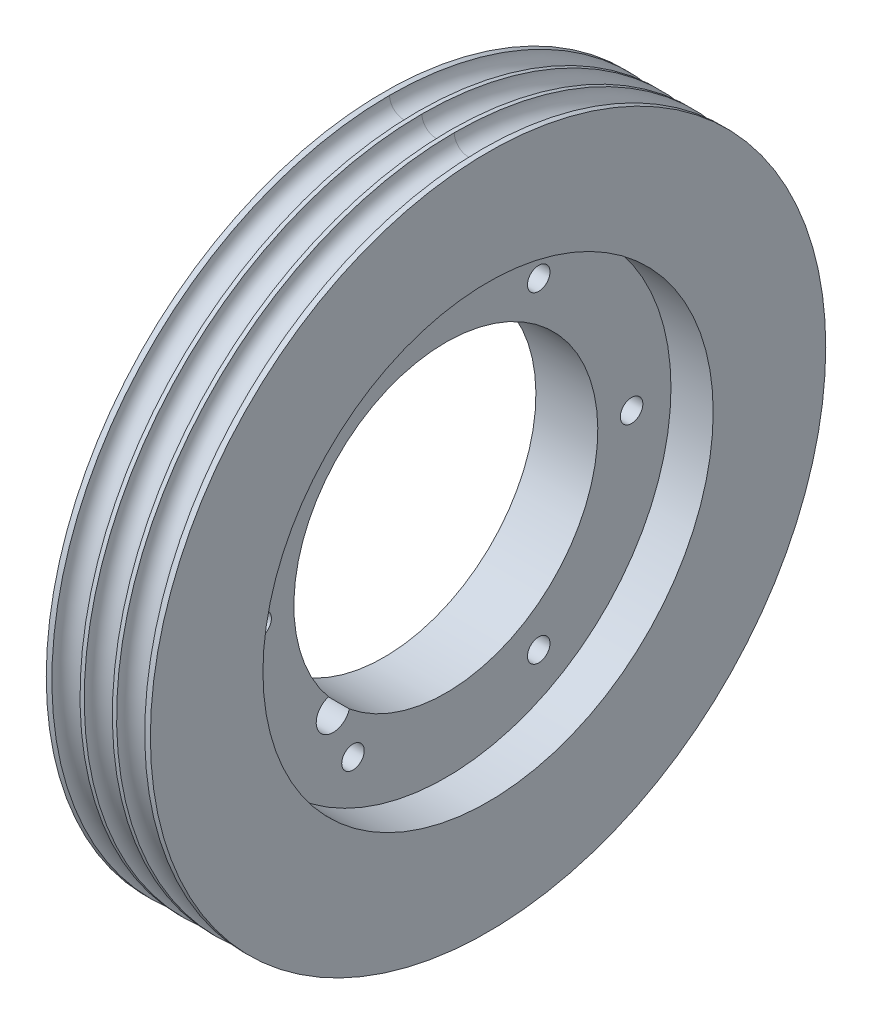
ISO-10303-21;
HEADER;
FILE_DESCRIPTION(('STEP AP214'),'2;1');
FILE_NAME('part.step','',(''),(''),'','','');
FILE_SCHEMA(('AUTOMOTIVE_DESIGN { 1 0 10303 214 1 1 1 1 }'));
ENDSEC;
DATA;
#1=APPLICATION_CONTEXT('core data for automotive mechanical design processes');
#2=APPLICATION_PROTOCOL_DEFINITION('international standard','automotive_design',2000,#1);
#3=PRODUCT_CONTEXT('',#1,'mechanical');
#4=PRODUCT('Part','Part','',(#3));
#5=PRODUCT_RELATED_PRODUCT_CATEGORY('part','',(#4));
#6=PRODUCT_DEFINITION_FORMATION('','',#4);
#7=PRODUCT_DEFINITION_CONTEXT('part definition',#1,'design');
#8=PRODUCT_DEFINITION('design','',#6,#7);
#9=PRODUCT_DEFINITION_SHAPE('','',#8);
#10=(LENGTH_UNIT() NAMED_UNIT(*) SI_UNIT(.MILLI.,.METRE.));
#11=(NAMED_UNIT(*) PLANE_ANGLE_UNIT() SI_UNIT($,.RADIAN.));
#12=(NAMED_UNIT(*) SI_UNIT($,.STERADIAN.) SOLID_ANGLE_UNIT());
#13=UNCERTAINTY_MEASURE_WITH_UNIT(LENGTH_MEASURE(1.E-05),#10,'distance_accuracy_value','');
#14=(GEOMETRIC_REPRESENTATION_CONTEXT(3) GLOBAL_UNCERTAINTY_ASSIGNED_CONTEXT((#13)) GLOBAL_UNIT_ASSIGNED_CONTEXT((#10,
#11,#12)) REPRESENTATION_CONTEXT('',''));
#15=CARTESIAN_POINT('',(0.,0.,0.));
#16=DIRECTION('',(0.,0.,1.));
#17=DIRECTION('',(1.,0.,0.));
#18=AXIS2_PLACEMENT_3D('',#15,#16,#17);
#19=CARTESIAN_POINT('',(5.75,0.,0.));
#20=DIRECTION('',(-1.,0.,0.));
#21=DIRECTION('',(0.,0.,1.));
#22=AXIS2_PLACEMENT_3D('',#19,#20,#21);
#23=CYLINDRICAL_SURFACE('',#22,27.);
#24=CARTESIAN_POINT('',(1.75,0.,0.));
#25=DIRECTION('',(1.,0.,0.));
#26=DIRECTION('',(0.,0.,-1.));
#27=AXIS2_PLACEMENT_3D('',#24,#25,#26);
#28=CIRCLE('',#27,27.);
#29=CARTESIAN_POINT('',(1.75,-17.1475452913862,20.8557351939427));
#30=VERTEX_POINT('',#29);
#31=CARTESIAN_POINT('',(1.75,-20.8557351939425,17.1475452913864));
#32=VERTEX_POINT('',#31);
#33=EDGE_CURVE('E46',#30,#32,#28,.F.);
#34=ORIENTED_EDGE('',*,*,#33,.F.);
#35=DIRECTION('',(-1.,0.,0.));
#36=VECTOR('',#35,1.);
#37=CARTESIAN_POINT('',(-1.75,-17.1475452913862,20.8557351939427));
#38=LINE('',#37,#36);
#39=CARTESIAN_POINT('',(-9.25,-17.1475452913862,20.8557351939427));
#40=VERTEX_POINT('',#39);
#41=EDGE_CURVE('E102',#40,#30,#38,.F.);
#42=ORIENTED_EDGE('',*,*,#41,.F.);
#43=CARTESIAN_POINT('',(-9.25,0.,0.));
#44=DIRECTION('',(-1.,0.,0.));
#45=DIRECTION('',(0.,0.,1.));
#46=AXIS2_PLACEMENT_3D('',#43,#44,#45);
#47=CIRCLE('',#46,27.);
#48=CARTESIAN_POINT('',(-9.25,-20.8557351939425,17.1475452913864));
#49=VERTEX_POINT('',#48);
#50=EDGE_CURVE('E158',#40,#49,#47,.T.);
#51=ORIENTED_EDGE('',*,*,#50,.T.);
#52=DIRECTION('',(-1.,0.,0.));
#53=VECTOR('',#52,1.);
#54=CARTESIAN_POINT('',(-1.75,-20.8557351939425,17.1475452913864));
#55=LINE('',#54,#53);
#56=EDGE_CURVE('E104',#32,#49,#55,.T.);
#57=ORIENTED_EDGE('',*,*,#56,.F.);
#58=EDGE_LOOP('',(#34,#42,#51,#57));
#59=FACE_BOUND('',#58,.T.);
#60=ADVANCED_FACE('F33',(#59),#23,.F.);
#61=CARTESIAN_POINT('',(5.75,0.,33.));
#62=DIRECTION('',(-1.,0.,0.));
#63=DIRECTION('',(0.,0.,1.));
#64=AXIS2_PLACEMENT_3D('',#61,#62,#63);
#65=CYLINDRICAL_SURFACE('',#64,2.);
#66=CARTESIAN_POINT('',(-6.25,0.,33.));
#67=DIRECTION('',(-1.,0.,0.));
#68=DIRECTION('',(0.,0.,1.));
#69=AXIS2_PLACEMENT_3D('',#66,#67,#68);
#70=CIRCLE('',#69,2.);
#71=CARTESIAN_POINT('',(-6.25,0.,35.));
#72=VERTEX_POINT('',#71);
#73=EDGE_CURVE('E153',#72,#72,#70,.F.);
#74=ORIENTED_EDGE('',*,*,#73,.F.);
#75=EDGE_LOOP('',(#74));
#76=FACE_BOUND('',#75,.T.);
#77=CARTESIAN_POINT('',(1.75,0.,33.));
#78=DIRECTION('',(1.,0.,0.));
#79=DIRECTION('',(0.,0.,-1.));
#80=AXIS2_PLACEMENT_3D('',#77,#78,#79);
#81=CIRCLE('',#80,2.);
#82=CARTESIAN_POINT('',(1.75,0.,31.));
#83=VERTEX_POINT('',#82);
#84=EDGE_CURVE('E288',#83,#83,#81,.F.);
#85=ORIENTED_EDGE('',*,*,#84,.F.);
#86=EDGE_LOOP('',(#85));
#87=FACE_BOUND('',#86,.T.);
#88=ADVANCED_FACE('F236',(#76,#87),#65,.F.);
#89=CARTESIAN_POINT('',(5.75,-28.5788383248863,16.5000000000003));
#90=DIRECTION('',(-1.,0.,0.));
#91=DIRECTION('',(0.,0.,1.));
#92=AXIS2_PLACEMENT_3D('',#89,#90,#91);
#93=CYLINDRICAL_SURFACE('',#92,2.);
#94=CARTESIAN_POINT('',(-6.25,-28.5788383248863,16.5000000000003));
#95=DIRECTION('',(-1.,0.,0.));
#96=DIRECTION('',(0.,0.,1.));
#97=AXIS2_PLACEMENT_3D('',#94,#95,#96);
#98=CIRCLE('',#97,2.);
#99=CARTESIAN_POINT('',(-6.25,-28.5788383248863,18.5000000000003));
#100=VERTEX_POINT('',#99);
#101=EDGE_CURVE('E147',#100,#100,#98,.F.);
#102=ORIENTED_EDGE('',*,*,#101,.F.);
#103=EDGE_LOOP('',(#102));
#104=FACE_BOUND('',#103,.T.);
#105=CARTESIAN_POINT('',(1.75,-28.5788383248863,16.5000000000003));
#106=DIRECTION('',(1.,0.,0.));
#107=DIRECTION('',(0.,0.,-1.));
#108=AXIS2_PLACEMENT_3D('',#105,#106,#107);
#109=CIRCLE('',#108,2.);
#110=CARTESIAN_POINT('',(1.75,-28.5788383248863,14.5000000000003));
#111=VERTEX_POINT('',#110);
#112=EDGE_CURVE('E291',#111,#111,#109,.F.);
#113=ORIENTED_EDGE('',*,*,#112,.F.);
#114=EDGE_LOOP('',(#113));
#115=FACE_BOUND('',#114,.T.);
#116=ADVANCED_FACE('F241',(#104,#115),#93,.F.);
#117=CARTESIAN_POINT('',(5.75,-28.5788383248866,-16.4999999999997));
#118=DIRECTION('',(-1.,0.,0.));
#119=DIRECTION('',(0.,0.,1.));
#120=AXIS2_PLACEMENT_3D('',#117,#118,#119);
#121=CYLINDRICAL_SURFACE('',#120,2.);
#122=CARTESIAN_POINT('',(-6.25,-28.5788383248866,-16.4999999999997));
#123=DIRECTION('',(-1.,0.,0.));
#124=DIRECTION('',(0.,0.,1.));
#125=AXIS2_PLACEMENT_3D('',#122,#123,#124);
#126=CIRCLE('',#125,2.);
#127=CARTESIAN_POINT('',(-6.25,-28.5788383248866,-14.4999999999997));
#128=VERTEX_POINT('',#127);
#129=EDGE_CURVE('E171',#128,#128,#126,.F.);
#130=ORIENTED_EDGE('',*,*,#129,.F.);
#131=EDGE_LOOP('',(#130));
#132=FACE_BOUND('',#131,.T.);
#133=CARTESIAN_POINT('',(1.75,-28.5788383248866,-16.4999999999997));
#134=DIRECTION('',(1.,0.,0.));
#135=DIRECTION('',(0.,0.,-1.));
#136=AXIS2_PLACEMENT_3D('',#133,#134,#135);
#137=CIRCLE('',#136,2.);
#138=CARTESIAN_POINT('',(1.75,-28.5788383248866,-18.4999999999997));
#139=VERTEX_POINT('',#138);
#140=EDGE_CURVE('E294',#139,#139,#137,.F.);
#141=ORIENTED_EDGE('',*,*,#140,.F.);
#142=EDGE_LOOP('',(#141));
#143=FACE_BOUND('',#142,.T.);
#144=ADVANCED_FACE('F389',(#132,#143),#121,.F.);
#145=CARTESIAN_POINT('',(5.75,0.,-33.));
#146=DIRECTION('',(-1.,0.,0.));
#147=DIRECTION('',(0.,0.,1.));
#148=AXIS2_PLACEMENT_3D('',#145,#146,#147);
#149=CYLINDRICAL_SURFACE('',#148,2.);
#150=CARTESIAN_POINT('',(-6.25,0.,-33.));
#151=DIRECTION('',(-1.,0.,0.));
#152=DIRECTION('',(0.,0.,1.));
#153=AXIS2_PLACEMENT_3D('',#150,#151,#152);
#154=CIRCLE('',#153,2.);
#155=CARTESIAN_POINT('',(-6.25,0.,-31.));
#156=VERTEX_POINT('',#155);
#157=EDGE_CURVE('E174',#156,#156,#154,.F.);
#158=ORIENTED_EDGE('',*,*,#157,.F.);
#159=EDGE_LOOP('',(#158));
#160=FACE_BOUND('',#159,.T.);
#161=CARTESIAN_POINT('',(1.75,0.,-33.));
#162=DIRECTION('',(1.,0.,0.));
#163=DIRECTION('',(0.,0.,-1.));
#164=AXIS2_PLACEMENT_3D('',#161,#162,#163);
#165=CIRCLE('',#164,2.);
#166=CARTESIAN_POINT('',(1.75,0.,-35.));
#167=VERTEX_POINT('',#166);
#168=EDGE_CURVE('E297',#167,#167,#165,.F.);
#169=ORIENTED_EDGE('',*,*,#168,.F.);
#170=EDGE_LOOP('',(#169));
#171=FACE_BOUND('',#170,.T.);
#172=ADVANCED_FACE('F385',(#160,#171),#149,.F.);
#173=CARTESIAN_POINT('',(5.75,28.5788383248864,-16.5000000000001));
#174=DIRECTION('',(-1.,0.,0.));
#175=DIRECTION('',(0.,0.,1.));
#176=AXIS2_PLACEMENT_3D('',#173,#174,#175);
#177=CYLINDRICAL_SURFACE('',#176,2.);
#178=CARTESIAN_POINT('',(-6.25,28.5788383248864,-16.5000000000001));
#179=DIRECTION('',(-1.,0.,0.));
#180=DIRECTION('',(0.,0.,1.));
#181=AXIS2_PLACEMENT_3D('',#178,#179,#180);
#182=CIRCLE('',#181,2.);
#183=CARTESIAN_POINT('',(-6.25,28.5788383248864,-14.5000000000001));
#184=VERTEX_POINT('',#183);
#185=EDGE_CURVE('E177',#184,#184,#182,.F.);
#186=ORIENTED_EDGE('',*,*,#185,.F.);
#187=EDGE_LOOP('',(#186));
#188=FACE_BOUND('',#187,.T.);
#189=CARTESIAN_POINT('',(1.75,28.5788383248864,-16.5000000000001));
#190=DIRECTION('',(1.,0.,0.));
#191=DIRECTION('',(0.,0.,-1.));
#192=AXIS2_PLACEMENT_3D('',#189,#190,#191);
#193=CIRCLE('',#192,2.);
#194=CARTESIAN_POINT('',(1.75,28.5788383248864,-18.5000000000001));
#195=VERTEX_POINT('',#194);
#196=EDGE_CURVE('E300',#195,#195,#193,.F.);
#197=ORIENTED_EDGE('',*,*,#196,.F.);
#198=EDGE_LOOP('',(#197));
#199=FACE_BOUND('',#198,.T.);
#200=ADVANCED_FACE('F382',(#188,#199),#177,.F.);
#201=CARTESIAN_POINT('',(5.75,28.5788383248865,16.4999999999999));
#202=DIRECTION('',(-1.,0.,0.));
#203=DIRECTION('',(0.,0.,1.));
#204=AXIS2_PLACEMENT_3D('',#201,#202,#203);
#205=CYLINDRICAL_SURFACE('',#204,2.);
#206=CARTESIAN_POINT('',(-6.25,28.5788383248865,16.4999999999999));
#207=DIRECTION('',(-1.,0.,0.));
#208=DIRECTION('',(0.,0.,1.));
#209=AXIS2_PLACEMENT_3D('',#206,#207,#208);
#210=CIRCLE('',#209,2.);
#211=CARTESIAN_POINT('',(-6.25,28.5788383248865,18.4999999999999));
#212=VERTEX_POINT('',#211);
#213=EDGE_CURVE('E157',#212,#212,#210,.F.);
#214=ORIENTED_EDGE('',*,*,#213,.F.);
#215=EDGE_LOOP('',(#214));
#216=FACE_BOUND('',#215,.T.);
#217=CARTESIAN_POINT('',(1.75,28.5788383248865,16.4999999999999));
#218=DIRECTION('',(1.,0.,0.));
#219=DIRECTION('',(0.,0.,-1.));
#220=AXIS2_PLACEMENT_3D('',#217,#218,#219);
#221=CIRCLE('',#220,2.);
#222=CARTESIAN_POINT('',(1.75,28.5788383248865,14.4999999999999));
#223=VERTEX_POINT('',#222);
#224=EDGE_CURVE('E105',#223,#223,#221,.F.);
#225=ORIENTED_EDGE('',*,*,#224,.F.);
#226=EDGE_LOOP('',(#225));
#227=FACE_BOUND('',#226,.T.);
#228=ADVANCED_FACE('F342',(#216,#227),#205,.F.);
#229=CARTESIAN_POINT('',(9.251,-20.0323351110148,20.032335111015));
#230=DIRECTION('',(-1.,0.,0.));
#231=DIRECTION('',(0.,0.,1.));
#232=AXIS2_PLACEMENT_3D('',#229,#230,#231);
#233=CYLINDRICAL_SURFACE('',#232,2.99999999999965);
#234=CARTESIAN_POINT('',(1.75,-20.0323351110148,20.032335111015));
#235=DIRECTION('',(1.,0.,0.));
#236=DIRECTION('',(0.,0.,-1.));
#237=AXIS2_PLACEMENT_3D('',#234,#235,#236);
#238=CIRCLE('',#237,2.99999999999965);
#239=EDGE_CURVE('E11',#32,#30,#238,.F.);
#240=ORIENTED_EDGE('',*,*,#239,.F.);
#241=ORIENTED_EDGE('',*,*,#56,.T.);
#242=CARTESIAN_POINT('',(-9.25,-20.0323351110148,20.032335111015));
#243=DIRECTION('',(-1.,0.,0.));
#244=DIRECTION('',(0.,0.,1.));
#245=AXIS2_PLACEMENT_3D('',#242,#243,#244);
#246=CIRCLE('',#245,2.99999999999965);
#247=EDGE_CURVE('E110',#49,#40,#246,.T.);
#248=ORIENTED_EDGE('',*,*,#247,.T.);
#249=ORIENTED_EDGE('',*,*,#41,.T.);
#250=EDGE_LOOP('',(#240,#241,#248,#249));
#251=FACE_BOUND('',#250,.T.);
#252=ADVANCED_FACE('F108',(#251),#233,.F.);
#253=CARTESIAN_POINT('',(9.25,0.,0.));
#254=DIRECTION('',(-1.,0.,0.));
#255=DIRECTION('',(0.,0.,1.));
#256=AXIS2_PLACEMENT_3D('',#253,#254,#255);
#257=CYLINDRICAL_SURFACE('',#256,60.);
#258=CARTESIAN_POINT('',(-3.2500100945521,0.,0.));
#259=DIRECTION('',(-1.,0.,0.));
#260=DIRECTION('',(0.,0.,1.));
#261=AXIS2_PLACEMENT_3D('',#258,#259,#260);
#262=CIRCLE('',#261,60.);
#263=CARTESIAN_POINT('',(-3.2500100945521,60.,0.));
#264=VERTEX_POINT('',#263);
#265=CARTESIAN_POINT('',(-3.2500100945521,0.,-60.));
#266=VERTEX_POINT('',#265);
#267=EDGE_CURVE('E193',#264,#266,#262,.T.);
#268=ORIENTED_EDGE('',*,*,#267,.F.);
#269=CARTESIAN_POINT('',(-3.2500100945521,0.,0.));
#270=DIRECTION('',(-1.,0.,0.));
#271=DIRECTION('',(0.,0.,1.));
#272=AXIS2_PLACEMENT_3D('',#269,#270,#271);
#273=CIRCLE('',#272,60.);
#274=EDGE_CURVE('E191',#266,#264,#273,.T.);
#275=ORIENTED_EDGE('',*,*,#274,.F.);
#276=EDGE_LOOP('',(#268,#275));
#277=FACE_BOUND('',#276,.T.);
#278=CARTESIAN_POINT('',(-2.49998990544789,0.,0.));
#279=DIRECTION('',(1.,0.,0.));
#280=DIRECTION('',(0.,0.,-1.));
#281=AXIS2_PLACEMENT_3D('',#278,#279,#280);
#282=CIRCLE('',#281,60.);
#283=CARTESIAN_POINT('',(-2.49998990544789,0.,-60.));
#284=VERTEX_POINT('',#283);
#285=CARTESIAN_POINT('',(-2.49998990544789,60.,0.));
#286=VERTEX_POINT('',#285);
#287=EDGE_CURVE('E41',#284,#286,#282,.T.);
#288=ORIENTED_EDGE('',*,*,#287,.F.);
#289=CARTESIAN_POINT('',(-2.49998990544789,0.,0.));
#290=DIRECTION('',(1.,0.,0.));
#291=DIRECTION('',(0.,0.,-1.));
#292=AXIS2_PLACEMENT_3D('',#289,#290,#291);
#293=CIRCLE('',#292,60.);
#294=EDGE_CURVE('E206',#286,#284,#293,.T.);
#295=ORIENTED_EDGE('',*,*,#294,.F.);
#296=EDGE_LOOP('',(#288,#295));
#297=FACE_BOUND('',#296,.T.);
#298=ADVANCED_FACE('F215',(#277,#297),#257,.T.);
#299=CARTESIAN_POINT('',(3.2500100945521,0.,0.));
#300=DIRECTION('',(1.,0.,0.));
#301=DIRECTION('',(0.,0.,-1.));
#302=AXIS2_PLACEMENT_3D('',#299,#300,#301);
#303=CIRCLE('',#302,60.);
#304=CARTESIAN_POINT('',(3.2500100945521,0.,-60.));
#305=VERTEX_POINT('',#304);
#306=CARTESIAN_POINT('',(3.2500100945521,60.,0.));
#307=VERTEX_POINT('',#306);
#308=EDGE_CURVE('E188',#305,#307,#303,.T.);
#309=ORIENTED_EDGE('',*,*,#308,.F.);
#310=CARTESIAN_POINT('',(3.2500100945521,0.,0.));
#311=DIRECTION('',(1.,0.,0.));
#312=DIRECTION('',(0.,0.,-1.));
#313=AXIS2_PLACEMENT_3D('',#310,#311,#312);
#314=CIRCLE('',#313,60.);
#315=EDGE_CURVE('E186',#307,#305,#314,.T.);
#316=ORIENTED_EDGE('',*,*,#315,.F.);
#317=EDGE_LOOP('',(#309,#316));
#318=FACE_BOUND('',#317,.T.);
#319=CARTESIAN_POINT('',(2.49998990544789,0.,0.));
#320=DIRECTION('',(-1.,0.,0.));
#321=DIRECTION('',(0.,0.,1.));
#322=AXIS2_PLACEMENT_3D('',#319,#320,#321);
#323=CIRCLE('',#322,60.);
#324=CARTESIAN_POINT('',(2.49998990544789,60.,0.));
#325=VERTEX_POINT('',#324);
#326=CARTESIAN_POINT('',(2.49998990544789,0.,-60.));
#327=VERTEX_POINT('',#326);
#328=EDGE_CURVE('E203',#325,#327,#323,.T.);
#329=ORIENTED_EDGE('',*,*,#328,.F.);
#330=CARTESIAN_POINT('',(2.49998990544789,0.,0.));
#331=DIRECTION('',(-1.,0.,0.));
#332=DIRECTION('',(0.,0.,1.));
#333=AXIS2_PLACEMENT_3D('',#330,#331,#332);
#334=CIRCLE('',#333,60.);
#335=EDGE_CURVE('E201',#327,#325,#334,.T.);
#336=ORIENTED_EDGE('',*,*,#335,.F.);
#337=EDGE_LOOP('',(#329,#336));
#338=FACE_BOUND('',#337,.T.);
#339=ADVANCED_FACE('F221',(#318,#338),#257,.T.);
#340=CARTESIAN_POINT('',(-9.25,0.,0.));
#341=DIRECTION('',(1.,0.,0.));
#342=DIRECTION('',(0.,0.,-1.));
#343=AXIS2_PLACEMENT_3D('',#340,#341,#342);
#344=CIRCLE('',#343,60.);
#345=CARTESIAN_POINT('',(-9.25,0.,-60.));
#346=VERTEX_POINT('',#345);
#347=EDGE_CURVE('E160',#346,#346,#344,.T.);
#348=ORIENTED_EDGE('',*,*,#347,.T.);
#349=EDGE_LOOP('',(#348));
#350=FACE_BOUND('',#349,.T.);
#351=CARTESIAN_POINT('',(-8.2499899054479,0.,0.));
#352=DIRECTION('',(1.,0.,0.));
#353=DIRECTION('',(0.,0.,-1.));
#354=AXIS2_PLACEMENT_3D('',#351,#352,#353);
#355=CIRCLE('',#354,60.);
#356=CARTESIAN_POINT('',(-8.2499899054479,0.,-59.9999999999999));
#357=VERTEX_POINT('',#356);
#358=CARTESIAN_POINT('',(-8.2499899054479,59.9999999999999,0.));
#359=VERTEX_POINT('',#358);
#360=EDGE_CURVE('E198',#357,#359,#355,.T.);
#361=ORIENTED_EDGE('',*,*,#360,.F.);
#362=CARTESIAN_POINT('',(-8.2499899054479,0.,0.));
#363=DIRECTION('',(1.,0.,0.));
#364=DIRECTION('',(0.,0.,-1.));
#365=AXIS2_PLACEMENT_3D('',#362,#363,#364);
#366=CIRCLE('',#365,60.);
#367=EDGE_CURVE('E196',#359,#357,#366,.T.);
#368=ORIENTED_EDGE('',*,*,#367,.F.);
#369=EDGE_LOOP('',(#361,#368));
#370=FACE_BOUND('',#369,.T.);
#371=ADVANCED_FACE('F35',(#350,#370),#257,.T.);
#372=CARTESIAN_POINT('',(9.25,0.,0.));
#373=DIRECTION('',(1.,0.,0.));
#374=DIRECTION('',(0.,0.,-1.));
#375=AXIS2_PLACEMENT_3D('',#372,#373,#374);
#376=CIRCLE('',#375,60.);
#377=CARTESIAN_POINT('',(9.25,0.,-60.));
#378=VERTEX_POINT('',#377);
#379=EDGE_CURVE('E161',#378,#378,#376,.T.);
#380=ORIENTED_EDGE('',*,*,#379,.F.);
#381=EDGE_LOOP('',(#380));
#382=FACE_BOUND('',#381,.T.);
#383=CARTESIAN_POINT('',(8.2499899054479,0.,0.));
#384=DIRECTION('',(-1.,0.,0.));
#385=DIRECTION('',(0.,0.,1.));
#386=AXIS2_PLACEMENT_3D('',#383,#384,#385);
#387=CIRCLE('',#386,60.);
#388=CARTESIAN_POINT('',(8.2499899054479,59.9999999999999,0.));
#389=VERTEX_POINT('',#388);
#390=CARTESIAN_POINT('',(8.2499899054479,0.,-59.9999999999999));
#391=VERTEX_POINT('',#390);
#392=EDGE_CURVE('E183',#389,#391,#387,.T.);
#393=ORIENTED_EDGE('',*,*,#392,.F.);
#394=CARTESIAN_POINT('',(8.2499899054479,0.,0.));
#395=DIRECTION('',(-1.,0.,0.));
#396=DIRECTION('',(0.,0.,1.));
#397=AXIS2_PLACEMENT_3D('',#394,#395,#396);
#398=CIRCLE('',#397,60.);
#399=EDGE_CURVE('E164',#391,#389,#398,.T.);
#400=ORIENTED_EDGE('',*,*,#399,.F.);
#401=EDGE_LOOP('',(#393,#400));
#402=FACE_BOUND('',#401,.T.);
#403=ADVANCED_FACE('F224',(#382,#402),#257,.T.);
#404=CARTESIAN_POINT('',(9.25,0.,0.));
#405=DIRECTION('',(1.,0.,0.));
#406=DIRECTION('',(0.,0.,-1.));
#407=AXIS2_PLACEMENT_3D('',#404,#405,#406);
#408=PLANE('',#407);
#409=CARTESIAN_POINT('',(9.25,0.,0.));
#410=DIRECTION('',(1.,0.,0.));
#411=DIRECTION('',(0.,0.,-1.));
#412=AXIS2_PLACEMENT_3D('',#409,#410,#411);
#413=CIRCLE('',#412,40.);
#414=CARTESIAN_POINT('',(9.25,0.,-40.));
#415=VERTEX_POINT('',#414);
#416=EDGE_CURVE('E305',#415,#415,#413,.T.);
#417=ORIENTED_EDGE('',*,*,#416,.F.);
#418=EDGE_LOOP('',(#417));
#419=FACE_BOUND('',#418,.T.);
#420=ORIENTED_EDGE('',*,*,#379,.T.);
#421=EDGE_LOOP('',(#420));
#422=FACE_BOUND('',#421,.T.);
#423=ADVANCED_FACE('F233',(#419,#422),#408,.T.);
#424=CARTESIAN_POINT('',(-9.25,0.,0.));
#425=DIRECTION('',(1.,0.,0.));
#426=DIRECTION('',(0.,0.,-1.));
#427=AXIS2_PLACEMENT_3D('',#424,#425,#426);
#428=PLANE('',#427);
#429=CARTESIAN_POINT('',(-9.25,-28.5788383248863,16.5000000000003));
#430=DIRECTION('',(-1.,0.,0.));
#431=DIRECTION('',(0.,-0.866025403784433,0.50000000000001));
#432=AXIS2_PLACEMENT_3D('',#429,#430,#431);
#433=CIRCLE('',#432,4.00000000000001);
#434=CARTESIAN_POINT('',(-9.25,-32.042939940024,18.5000000000004));
#435=VERTEX_POINT('',#434);
#436=EDGE_CURVE('E119',#435,#435,#433,.T.);
#437=ORIENTED_EDGE('',*,*,#436,.F.);
#438=EDGE_LOOP('',(#437));
#439=FACE_BOUND('',#438,.T.);
#440=CARTESIAN_POINT('',(-9.25,-28.5788383248866,-16.4999999999997));
#441=DIRECTION('',(-1.,0.,0.));
#442=DIRECTION('',(0.,-0.866025403784443,-0.499999999999992));
#443=AXIS2_PLACEMENT_3D('',#440,#441,#442);
#444=CIRCLE('',#443,4.00000000000001);
#445=CARTESIAN_POINT('',(-9.25,-32.0429399400244,-18.4999999999997));
#446=VERTEX_POINT('',#445);
#447=EDGE_CURVE('E136',#446,#446,#444,.T.);
#448=ORIENTED_EDGE('',*,*,#447,.F.);
#449=EDGE_LOOP('',(#448));
#450=FACE_BOUND('',#449,.T.);
#451=CARTESIAN_POINT('',(-9.25,0.,-33.));
#452=DIRECTION('',(-1.,0.,0.));
#453=DIRECTION('',(0.,0.,-1.));
#454=AXIS2_PLACEMENT_3D('',#451,#452,#453);
#455=CIRCLE('',#454,4.00000000000001);
#456=CARTESIAN_POINT('',(-9.25,0.,-37.));
#457=VERTEX_POINT('',#456);
#458=EDGE_CURVE('E130',#457,#457,#455,.T.);
#459=ORIENTED_EDGE('',*,*,#458,.F.);
#460=EDGE_LOOP('',(#459));
#461=FACE_BOUND('',#460,.T.);
#462=CARTESIAN_POINT('',(-9.25,28.5788383248864,-16.5000000000001));
#463=DIRECTION('',(-1.,0.,0.));
#464=DIRECTION('',(0.,0.866025403784436,-0.500000000000004));
#465=AXIS2_PLACEMENT_3D('',#462,#463,#464);
#466=CIRCLE('',#465,4.00000000000001);
#467=CARTESIAN_POINT('',(-9.25,32.0429399400242,-18.5000000000002));
#468=VERTEX_POINT('',#467);
#469=EDGE_CURVE('E124',#468,#468,#466,.T.);
#470=ORIENTED_EDGE('',*,*,#469,.F.);
#471=EDGE_LOOP('',(#470));
#472=FACE_BOUND('',#471,.T.);
#473=CARTESIAN_POINT('',(-9.25,28.5788383248865,16.4999999999999));
#474=DIRECTION('',(-1.,0.,0.));
#475=DIRECTION('',(0.,0.86602540378444,0.499999999999998));
#476=AXIS2_PLACEMENT_3D('',#473,#474,#475);
#477=CIRCLE('',#476,4.00000000000001);
#478=CARTESIAN_POINT('',(-9.25,32.0429399400243,18.4999999999999));
#479=VERTEX_POINT('',#478);
#480=EDGE_CURVE('E123',#479,#479,#477,.T.);
#481=ORIENTED_EDGE('',*,*,#480,.F.);
#482=EDGE_LOOP('',(#481));
#483=FACE_BOUND('',#482,.T.);
#484=CARTESIAN_POINT('',(-9.25,0.,33.));
#485=DIRECTION('',(-1.,0.,0.));
#486=DIRECTION('',(0.,0.,1.));
#487=AXIS2_PLACEMENT_3D('',#484,#485,#486);
#488=CIRCLE('',#487,4.00000000000001);
#489=CARTESIAN_POINT('',(-9.25,0.,37.));
#490=VERTEX_POINT('',#489);
#491=EDGE_CURVE('E154',#490,#490,#488,.T.);
#492=ORIENTED_EDGE('',*,*,#491,.F.);
#493=EDGE_LOOP('',(#492));
#494=FACE_BOUND('',#493,.T.);
#495=ORIENTED_EDGE('',*,*,#50,.F.);
#496=ORIENTED_EDGE('',*,*,#247,.F.);
#497=EDGE_LOOP('',(#495,#496));
#498=FACE_BOUND('',#497,.T.);
#499=ORIENTED_EDGE('',*,*,#347,.F.);
#500=EDGE_LOOP('',(#499));
#501=FACE_BOUND('',#500,.T.);
#502=ADVANCED_FACE('F247',(#439,#450,#461,#472,#483,#494,#498,#501),#428,.F.);
#503=CARTESIAN_POINT('',(-6.25,0.,33.));
#504=DIRECTION('',(-1.,0.,0.));
#505=DIRECTION('',(0.,0.,1.));
#506=AXIS2_PLACEMENT_3D('',#503,#504,#505);
#507=PLANE('',#506);
#508=CARTESIAN_POINT('',(-6.25,0.,33.));
#509=DIRECTION('',(-1.,0.,0.));
#510=DIRECTION('',(0.,0.,1.));
#511=AXIS2_PLACEMENT_3D('',#508,#509,#510);
#512=CIRCLE('',#511,4.00000000000001);
#513=CARTESIAN_POINT('',(-6.25,0.,37.));
#514=VERTEX_POINT('',#513);
#515=EDGE_CURVE('E150',#514,#514,#512,.T.);
#516=ORIENTED_EDGE('',*,*,#515,.T.);
#517=EDGE_LOOP('',(#516));
#518=FACE_BOUND('',#517,.T.);
#519=ORIENTED_EDGE('',*,*,#73,.T.);
#520=EDGE_LOOP('',(#519));
#521=FACE_BOUND('',#520,.T.);
#522=ADVANCED_FACE('F250',(#518,#521),#507,.T.);
#523=CARTESIAN_POINT('',(-6.25,0.,33.));
#524=DIRECTION('',(-1.,0.,0.));
#525=DIRECTION('',(0.,0.,1.));
#526=AXIS2_PLACEMENT_3D('',#523,#524,#525);
#527=CYLINDRICAL_SURFACE('',#526,4.00000000000001);
#528=ORIENTED_EDGE('',*,*,#515,.F.);
#529=EDGE_LOOP('',(#528));
#530=FACE_BOUND('',#529,.T.);
#531=ORIENTED_EDGE('',*,*,#491,.T.);
#532=EDGE_LOOP('',(#531));
#533=FACE_BOUND('',#532,.T.);
#534=ADVANCED_FACE('F255',(#530,#533),#527,.F.);
#535=CARTESIAN_POINT('',(-6.25,-28.5788383248863,16.5000000000003));
#536=DIRECTION('',(-1.,0.,0.));
#537=DIRECTION('',(0.,-0.866025403784433,0.50000000000001));
#538=AXIS2_PLACEMENT_3D('',#535,#536,#537);
#539=PLANE('',#538);
#540=CARTESIAN_POINT('',(-6.25,-28.5788383248863,16.5000000000003));
#541=DIRECTION('',(-1.,0.,0.));
#542=DIRECTION('',(0.,-0.866025403784433,0.50000000000001));
#543=AXIS2_PLACEMENT_3D('',#540,#541,#542);
#544=CIRCLE('',#543,4.00000000000001);
#545=CARTESIAN_POINT('',(-6.25,-32.042939940024,18.5000000000004));
#546=VERTEX_POINT('',#545);
#547=EDGE_CURVE('E139',#546,#546,#544,.T.);
#548=ORIENTED_EDGE('',*,*,#547,.T.);
#549=EDGE_LOOP('',(#548));
#550=FACE_BOUND('',#549,.T.);
#551=ORIENTED_EDGE('',*,*,#101,.T.);
#552=EDGE_LOOP('',(#551));
#553=FACE_BOUND('',#552,.T.);
#554=ADVANCED_FACE('F369',(#550,#553),#539,.T.);
#555=CARTESIAN_POINT('',(-6.25,-28.5788383248863,16.5000000000003));
#556=DIRECTION('',(-1.,0.,0.));
#557=DIRECTION('',(0.,0.,1.));
#558=AXIS2_PLACEMENT_3D('',#555,#556,#557);
#559=CYLINDRICAL_SURFACE('',#558,4.00000000000001);
#560=ORIENTED_EDGE('',*,*,#547,.F.);
#561=EDGE_LOOP('',(#560));
#562=FACE_BOUND('',#561,.T.);
#563=ORIENTED_EDGE('',*,*,#436,.T.);
#564=EDGE_LOOP('',(#563));
#565=FACE_BOUND('',#564,.T.);
#566=ADVANCED_FACE('F364',(#562,#565),#559,.F.);
#567=CARTESIAN_POINT('',(-6.25,-28.5788383248866,-16.4999999999997));
#568=DIRECTION('',(-1.,0.,0.));
#569=DIRECTION('',(0.,-0.866025403784443,-0.499999999999992));
#570=AXIS2_PLACEMENT_3D('',#567,#568,#569);
#571=PLANE('',#570);
#572=CARTESIAN_POINT('',(-6.25,-28.5788383248866,-16.4999999999997));
#573=DIRECTION('',(-1.,0.,0.));
#574=DIRECTION('',(0.,-0.866025403784443,-0.499999999999992));
#575=AXIS2_PLACEMENT_3D('',#572,#573,#574);
#576=CIRCLE('',#575,4.00000000000001);
#577=CARTESIAN_POINT('',(-6.25,-32.0429399400244,-18.4999999999997));
#578=VERTEX_POINT('',#577);
#579=EDGE_CURVE('E133',#578,#578,#576,.T.);
#580=ORIENTED_EDGE('',*,*,#579,.T.);
#581=EDGE_LOOP('',(#580));
#582=FACE_BOUND('',#581,.T.);
#583=ORIENTED_EDGE('',*,*,#129,.T.);
#584=EDGE_LOOP('',(#583));
#585=FACE_BOUND('',#584,.T.);
#586=ADVANCED_FACE('F361',(#582,#585),#571,.T.);
#587=CARTESIAN_POINT('',(-6.25,-28.5788383248866,-16.4999999999997));
#588=DIRECTION('',(-1.,0.,0.));
#589=DIRECTION('',(0.,0.,1.));
#590=AXIS2_PLACEMENT_3D('',#587,#588,#589);
#591=CYLINDRICAL_SURFACE('',#590,4.00000000000001);
#592=ORIENTED_EDGE('',*,*,#579,.F.);
#593=EDGE_LOOP('',(#592));
#594=FACE_BOUND('',#593,.T.);
#595=ORIENTED_EDGE('',*,*,#447,.T.);
#596=EDGE_LOOP('',(#595));
#597=FACE_BOUND('',#596,.T.);
#598=ADVANCED_FACE('F356',(#594,#597),#591,.F.);
#599=CARTESIAN_POINT('',(-6.25,0.,-33.));
#600=DIRECTION('',(-1.,0.,0.));
#601=DIRECTION('',(0.,0.,-1.));
#602=AXIS2_PLACEMENT_3D('',#599,#600,#601);
#603=PLANE('',#602);
#604=CARTESIAN_POINT('',(-6.25,0.,-33.));
#605=DIRECTION('',(-1.,0.,0.));
#606=DIRECTION('',(0.,0.,-1.));
#607=AXIS2_PLACEMENT_3D('',#604,#605,#606);
#608=CIRCLE('',#607,4.00000000000001);
#609=CARTESIAN_POINT('',(-6.25,0.,-37.));
#610=VERTEX_POINT('',#609);
#611=EDGE_CURVE('E127',#610,#610,#608,.T.);
#612=ORIENTED_EDGE('',*,*,#611,.T.);
#613=EDGE_LOOP('',(#612));
#614=FACE_BOUND('',#613,.T.);
#615=ORIENTED_EDGE('',*,*,#157,.T.);
#616=EDGE_LOOP('',(#615));
#617=FACE_BOUND('',#616,.T.);
#618=ADVANCED_FACE('F353',(#614,#617),#603,.T.);
#619=CARTESIAN_POINT('',(-6.25,0.,-33.));
#620=DIRECTION('',(-1.,0.,0.));
#621=DIRECTION('',(0.,0.,1.));
#622=AXIS2_PLACEMENT_3D('',#619,#620,#621);
#623=CYLINDRICAL_SURFACE('',#622,4.00000000000001);
#624=ORIENTED_EDGE('',*,*,#611,.F.);
#625=EDGE_LOOP('',(#624));
#626=FACE_BOUND('',#625,.T.);
#627=ORIENTED_EDGE('',*,*,#458,.T.);
#628=EDGE_LOOP('',(#627));
#629=FACE_BOUND('',#628,.T.);
#630=ADVANCED_FACE('F347',(#626,#629),#623,.F.);
#631=CARTESIAN_POINT('',(-6.25,28.5788383248864,-16.5000000000001));
#632=DIRECTION('',(-1.,0.,0.));
#633=DIRECTION('',(0.,0.866025403784436,-0.500000000000004));
#634=AXIS2_PLACEMENT_3D('',#631,#632,#633);
#635=PLANE('',#634);
#636=CARTESIAN_POINT('',(-6.25,28.5788383248864,-16.5000000000001));
#637=DIRECTION('',(-1.,0.,0.));
#638=DIRECTION('',(0.,0.866025403784436,-0.500000000000004));
#639=AXIS2_PLACEMENT_3D('',#636,#637,#638);
#640=CIRCLE('',#639,4.00000000000001);
#641=CARTESIAN_POINT('',(-6.25,32.0429399400242,-18.5000000000002));
#642=VERTEX_POINT('',#641);
#643=EDGE_CURVE('E120',#642,#642,#640,.T.);
#644=ORIENTED_EDGE('',*,*,#643,.T.);
#645=EDGE_LOOP('',(#644));
#646=FACE_BOUND('',#645,.T.);
#647=ORIENTED_EDGE('',*,*,#185,.T.);
#648=EDGE_LOOP('',(#647));
#649=FACE_BOUND('',#648,.T.);
#650=ADVANCED_FACE('F343',(#646,#649),#635,.T.);
#651=CARTESIAN_POINT('',(-6.25,28.5788383248864,-16.5000000000001));
#652=DIRECTION('',(-1.,0.,0.));
#653=DIRECTION('',(0.,0.,1.));
#654=AXIS2_PLACEMENT_3D('',#651,#652,#653);
#655=CYLINDRICAL_SURFACE('',#654,4.00000000000001);
#656=ORIENTED_EDGE('',*,*,#643,.F.);
#657=EDGE_LOOP('',(#656));
#658=FACE_BOUND('',#657,.T.);
#659=ORIENTED_EDGE('',*,*,#469,.T.);
#660=EDGE_LOOP('',(#659));
#661=FACE_BOUND('',#660,.T.);
#662=ADVANCED_FACE('F346',(#658,#661),#655,.F.);
#663=CARTESIAN_POINT('',(-6.25,28.5788383248865,16.4999999999999));
#664=DIRECTION('',(-1.,0.,0.));
#665=DIRECTION('',(0.,0.86602540378444,0.499999999999998));
#666=AXIS2_PLACEMENT_3D('',#663,#664,#665);
#667=PLANE('',#666);
#668=CARTESIAN_POINT('',(-6.25,28.5788383248865,16.4999999999999));
#669=DIRECTION('',(-1.,0.,0.));
#670=DIRECTION('',(0.,0.86602540378444,0.499999999999998));
#671=AXIS2_PLACEMENT_3D('',#668,#669,#670);
#672=CIRCLE('',#671,4.00000000000001);
#673=CARTESIAN_POINT('',(-6.25,32.0429399400243,18.4999999999999));
#674=VERTEX_POINT('',#673);
#675=EDGE_CURVE('E144',#674,#674,#672,.T.);
#676=ORIENTED_EDGE('',*,*,#675,.T.);
#677=EDGE_LOOP('',(#676));
#678=FACE_BOUND('',#677,.T.);
#679=ORIENTED_EDGE('',*,*,#213,.T.);
#680=EDGE_LOOP('',(#679));
#681=FACE_BOUND('',#680,.T.);
#682=ADVANCED_FACE('F351',(#678,#681),#667,.T.);
#683=CARTESIAN_POINT('',(-6.25,28.5788383248865,16.4999999999999));
#684=DIRECTION('',(-1.,0.,0.));
#685=DIRECTION('',(0.,0.,1.));
#686=AXIS2_PLACEMENT_3D('',#683,#684,#685);
#687=CYLINDRICAL_SURFACE('',#686,4.00000000000001);
#688=ORIENTED_EDGE('',*,*,#675,.F.);
#689=EDGE_LOOP('',(#688));
#690=FACE_BOUND('',#689,.T.);
#691=ORIENTED_EDGE('',*,*,#480,.T.);
#692=EDGE_LOOP('',(#691));
#693=FACE_BOUND('',#692,.T.);
#694=ADVANCED_FACE('F336',(#690,#693),#687,.F.);
#695=CARTESIAN_POINT('',(5.75,0.,0.));
#696=DIRECTION('',(-1.,0.,0.));
#697=DIRECTION('',(0.,0.,1.));
#698=AXIS2_PLACEMENT_3D('',#695,#696,#697);
#699=TOROIDAL_SURFACE('',#698,60.0071044112096,2.5);
#700=ORIENTED_EDGE('',*,*,#308,.T.);
#701=CARTESIAN_POINT('',(5.75,60.0071044112096,0.));
#702=DIRECTION('',(0.,0.,1.));
#703=DIRECTION('',(1.,0.,0.));
#704=AXIS2_PLACEMENT_3D('',#701,#702,#703);
#705=CIRCLE('',#704,2.5);
#706=EDGE_CURVE('E114',#307,#389,#705,.T.);
#707=ORIENTED_EDGE('',*,*,#706,.T.);
#708=ORIENTED_EDGE('',*,*,#392,.T.);
#709=CARTESIAN_POINT('',(5.75,0.,-60.0071044112096));
#710=DIRECTION('',(0.,1.,0.));
#711=DIRECTION('',(1.,0.,0.));
#712=AXIS2_PLACEMENT_3D('',#709,#710,#711);
#713=CIRCLE('',#712,2.5);
#714=EDGE_CURVE('E111',#305,#391,#713,.T.);
#715=ORIENTED_EDGE('',*,*,#714,.F.);
#716=EDGE_LOOP('',(#700,#707,#708,#715));
#717=FACE_BOUND('',#716,.T.);
#718=ADVANCED_FACE('F324',(#717),#699,.F.);
#719=CARTESIAN_POINT('',(5.75,0.,0.));
#720=DIRECTION('',(-1.,0.,0.));
#721=DIRECTION('',(0.,0.,1.));
#722=AXIS2_PLACEMENT_3D('',#719,#720,#721);
#723=TOROIDAL_SURFACE('',#722,60.0071044112096,2.5);
#724=ORIENTED_EDGE('',*,*,#315,.T.);
#725=ORIENTED_EDGE('',*,*,#714,.T.);
#726=ORIENTED_EDGE('',*,*,#399,.T.);
#727=ORIENTED_EDGE('',*,*,#706,.F.);
#728=EDGE_LOOP('',(#724,#725,#726,#727));
#729=FACE_BOUND('',#728,.T.);
#730=ADVANCED_FACE('F327',(#729),#723,.F.);
#731=CARTESIAN_POINT('',(-5.75,0.,0.));
#732=DIRECTION('',(-1.,0.,0.));
#733=DIRECTION('',(0.,0.,1.));
#734=AXIS2_PLACEMENT_3D('',#731,#732,#733);
#735=TOROIDAL_SURFACE('',#734,60.0071044112096,2.5);
#736=ORIENTED_EDGE('',*,*,#360,.T.);
#737=CARTESIAN_POINT('',(-5.75,60.0071044112096,0.));
#738=DIRECTION('',(0.,0.,1.));
#739=DIRECTION('',(-1.,0.,0.));
#740=AXIS2_PLACEMENT_3D('',#737,#738,#739);
#741=CIRCLE('',#740,2.5);
#742=EDGE_CURVE('E218',#359,#264,#741,.T.);
#743=ORIENTED_EDGE('',*,*,#742,.T.);
#744=ORIENTED_EDGE('',*,*,#267,.T.);
#745=CARTESIAN_POINT('',(-5.75,0.,-60.0071044112096));
#746=DIRECTION('',(0.,1.,0.));
#747=DIRECTION('',(-1.,0.,0.));
#748=AXIS2_PLACEMENT_3D('',#745,#746,#747);
#749=CIRCLE('',#748,2.5);
#750=EDGE_CURVE('E280',#357,#266,#749,.T.);
#751=ORIENTED_EDGE('',*,*,#750,.F.);
#752=EDGE_LOOP('',(#736,#743,#744,#751));
#753=FACE_BOUND('',#752,.T.);
#754=ADVANCED_FACE('F278',(#753),#735,.F.);
#755=CARTESIAN_POINT('',(-5.75,0.,0.));
#756=DIRECTION('',(-1.,0.,0.));
#757=DIRECTION('',(0.,0.,1.));
#758=AXIS2_PLACEMENT_3D('',#755,#756,#757);
#759=TOROIDAL_SURFACE('',#758,60.0071044112096,2.5);
#760=ORIENTED_EDGE('',*,*,#367,.T.);
#761=ORIENTED_EDGE('',*,*,#750,.T.);
#762=ORIENTED_EDGE('',*,*,#274,.T.);
#763=ORIENTED_EDGE('',*,*,#742,.F.);
#764=EDGE_LOOP('',(#760,#761,#762,#763));
#765=FACE_BOUND('',#764,.T.);
#766=ADVANCED_FACE('F334',(#765),#759,.F.);
#767=CARTESIAN_POINT('',(0.,0.,0.));
#768=DIRECTION('',(-1.,0.,0.));
#769=DIRECTION('',(0.,0.,1.));
#770=AXIS2_PLACEMENT_3D('',#767,#768,#769);
#771=TOROIDAL_SURFACE('',#770,60.0071044112096,2.5);
#772=ORIENTED_EDGE('',*,*,#287,.T.);
#773=CARTESIAN_POINT('',(0.,60.0071044112096,0.));
#774=DIRECTION('',(0.,0.,1.));
#775=DIRECTION('',(1.,0.,0.));
#776=AXIS2_PLACEMENT_3D('',#773,#774,#775);
#777=CIRCLE('',#776,2.5);
#778=EDGE_CURVE('E54',#286,#325,#777,.T.);
#779=ORIENTED_EDGE('',*,*,#778,.T.);
#780=ORIENTED_EDGE('',*,*,#328,.T.);
#781=CARTESIAN_POINT('',(0.,0.,-60.0071044112096));
#782=DIRECTION('',(0.,1.,0.));
#783=DIRECTION('',(1.,0.,0.));
#784=AXIS2_PLACEMENT_3D('',#781,#782,#783);
#785=CIRCLE('',#784,2.5);
#786=EDGE_CURVE('E213',#284,#327,#785,.T.);
#787=ORIENTED_EDGE('',*,*,#786,.F.);
#788=EDGE_LOOP('',(#772,#779,#780,#787));
#789=FACE_BOUND('',#788,.T.);
#790=ADVANCED_FACE('F211',(#789),#771,.F.);
#791=CARTESIAN_POINT('',(0.,0.,0.));
#792=DIRECTION('',(-1.,0.,0.));
#793=DIRECTION('',(0.,0.,1.));
#794=AXIS2_PLACEMENT_3D('',#791,#792,#793);
#795=TOROIDAL_SURFACE('',#794,60.0071044112096,2.5);
#796=ORIENTED_EDGE('',*,*,#294,.T.);
#797=ORIENTED_EDGE('',*,*,#786,.T.);
#798=ORIENTED_EDGE('',*,*,#335,.T.);
#799=ORIENTED_EDGE('',*,*,#778,.F.);
#800=EDGE_LOOP('',(#796,#797,#798,#799));
#801=FACE_BOUND('',#800,.T.);
#802=ADVANCED_FACE('F216',(#801),#795,.F.);
#803=CARTESIAN_POINT('',(1.75,0.,0.));
#804=DIRECTION('',(1.,0.,0.));
#805=DIRECTION('',(0.,0.,-1.));
#806=AXIS2_PLACEMENT_3D('',#803,#804,#805);
#807=PLANE('',#806);
#808=CARTESIAN_POINT('',(1.75,0.,0.));
#809=DIRECTION('',(1.,0.,0.));
#810=DIRECTION('',(0.,0.,-1.));
#811=AXIS2_PLACEMENT_3D('',#808,#809,#810);
#812=CIRCLE('',#811,40.);
#813=CARTESIAN_POINT('',(1.75,0.,-40.));
#814=VERTEX_POINT('',#813);
#815=EDGE_CURVE('E106',#814,#814,#812,.T.);
#816=ORIENTED_EDGE('',*,*,#815,.T.);
#817=EDGE_LOOP('',(#816));
#818=FACE_BOUND('',#817,.T.);
#819=ORIENTED_EDGE('',*,*,#33,.T.);
#820=ORIENTED_EDGE('',*,*,#239,.T.);
#821=EDGE_LOOP('',(#819,#820));
#822=FACE_BOUND('',#821,.T.);
#823=ORIENTED_EDGE('',*,*,#224,.T.);
#824=EDGE_LOOP('',(#823));
#825=FACE_BOUND('',#824,.T.);
#826=ORIENTED_EDGE('',*,*,#196,.T.);
#827=EDGE_LOOP('',(#826));
#828=FACE_BOUND('',#827,.T.);
#829=ORIENTED_EDGE('',*,*,#168,.T.);
#830=EDGE_LOOP('',(#829));
#831=FACE_BOUND('',#830,.T.);
#832=ORIENTED_EDGE('',*,*,#140,.T.);
#833=EDGE_LOOP('',(#832));
#834=FACE_BOUND('',#833,.T.);
#835=ORIENTED_EDGE('',*,*,#112,.T.);
#836=EDGE_LOOP('',(#835));
#837=FACE_BOUND('',#836,.T.);
#838=ORIENTED_EDGE('',*,*,#84,.T.);
#839=EDGE_LOOP('',(#838));
#840=FACE_BOUND('',#839,.T.);
#841=ADVANCED_FACE('F94',(#818,#822,#825,#828,#831,#834,#837,#840),#807,.T.);
#842=CARTESIAN_POINT('',(1.75,0.,0.));
#843=DIRECTION('',(1.,0.,0.));
#844=DIRECTION('',(0.,0.,-1.));
#845=AXIS2_PLACEMENT_3D('',#842,#843,#844);
#846=CYLINDRICAL_SURFACE('',#845,40.);
#847=ORIENTED_EDGE('',*,*,#815,.F.);
#848=EDGE_LOOP('',(#847));
#849=FACE_BOUND('',#848,.T.);
#850=ORIENTED_EDGE('',*,*,#416,.T.);
#851=EDGE_LOOP('',(#850));
#852=FACE_BOUND('',#851,.T.);
#853=ADVANCED_FACE('F312',(#849,#852),#846,.F.);
#854=CLOSED_SHELL('',(#60,#88,#116,#144,#172,#200,#228,#252,#298,#339,#371,#403,#423,#502,#522,
#534,#554,#566,#586,#598,#618,#630,#650,#662,#682,#694,#718,#730,#754,#766,#790,#802,#841,#853));
#855=MANIFOLD_SOLID_BREP('B2',#854);
#856=ADVANCED_BREP_SHAPE_REPRESENTATION('',(#18,#855),#14);
#857=SHAPE_DEFINITION_REPRESENTATION(#9,#856);
ENDSEC;
END-ISO-10303-21;
